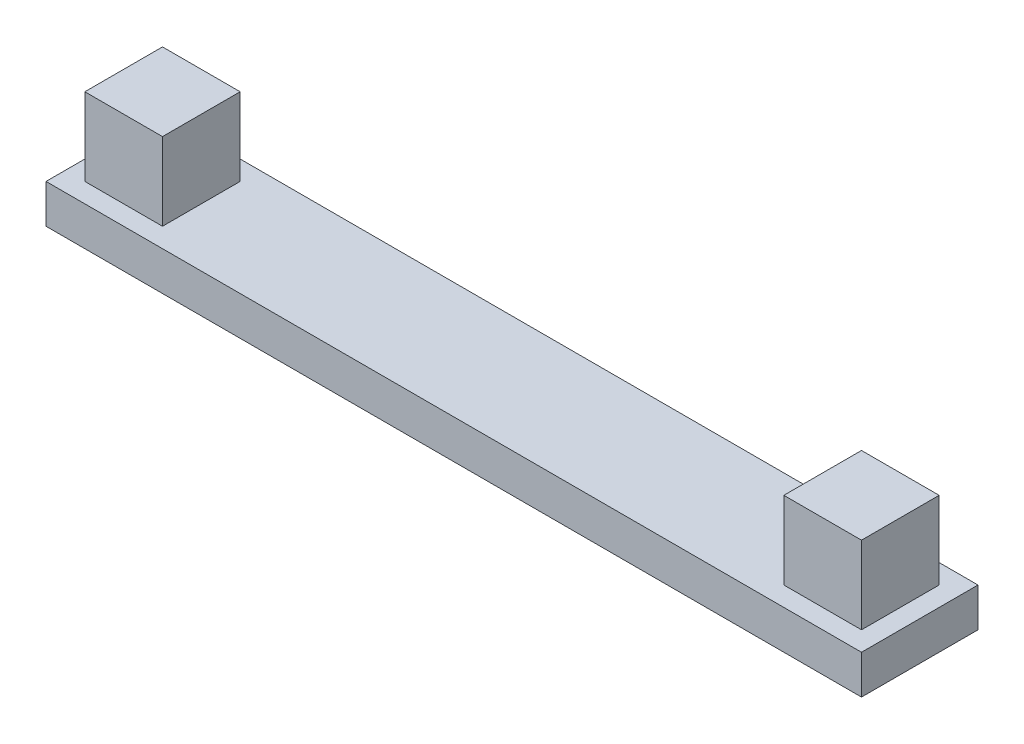
ISO-10303-21;
HEADER;
FILE_DESCRIPTION(('STEP AP214'),'2;1');
FILE_NAME('part.step','',(''),(''),'','','');
FILE_SCHEMA(('AUTOMOTIVE_DESIGN { 1 0 10303 214 1 1 1 1 }'));
ENDSEC;
DATA;
#1=APPLICATION_CONTEXT('core data for automotive mechanical design processes');
#2=APPLICATION_PROTOCOL_DEFINITION('international standard','automotive_design',2000,#1);
#3=PRODUCT_CONTEXT('',#1,'mechanical');
#4=PRODUCT('Part','Part','',(#3));
#5=PRODUCT_RELATED_PRODUCT_CATEGORY('part','',(#4));
#6=PRODUCT_DEFINITION_FORMATION('','',#4);
#7=PRODUCT_DEFINITION_CONTEXT('part definition',#1,'design');
#8=PRODUCT_DEFINITION('design','',#6,#7);
#9=PRODUCT_DEFINITION_SHAPE('','',#8);
#10=(LENGTH_UNIT() NAMED_UNIT(*) SI_UNIT(.MILLI.,.METRE.));
#11=(NAMED_UNIT(*) PLANE_ANGLE_UNIT() SI_UNIT($,.RADIAN.));
#12=(NAMED_UNIT(*) SI_UNIT($,.STERADIAN.) SOLID_ANGLE_UNIT());
#13=UNCERTAINTY_MEASURE_WITH_UNIT(LENGTH_MEASURE(1.E-05),#10,'distance_accuracy_value','');
#14=(GEOMETRIC_REPRESENTATION_CONTEXT(3) GLOBAL_UNCERTAINTY_ASSIGNED_CONTEXT((#13)) GLOBAL_UNIT_ASSIGNED_CONTEXT((#10,
#11,#12)) REPRESENTATION_CONTEXT('',''));
#15=CARTESIAN_POINT('',(0.,0.,0.));
#16=DIRECTION('',(0.,0.,1.));
#17=DIRECTION('',(1.,0.,0.));
#18=AXIS2_PLACEMENT_3D('',#15,#16,#17);
#19=CARTESIAN_POINT('',(0.,1.,0.));
#20=DIRECTION('',(0.,0.,-1.));
#21=DIRECTION('',(-1.,0.,0.));
#22=AXIS2_PLACEMENT_3D('',#19,#20,#21);
#23=PLANE('',#22);
#24=DIRECTION('',(1.,0.,0.));
#25=VECTOR('',#24,1.);
#26=CARTESIAN_POINT('',(0.,0.,0.));
#27=LINE('',#26,#25);
#28=CARTESIAN_POINT('',(0.,0.,0.));
#29=VERTEX_POINT('',#28);
#30=CARTESIAN_POINT('',(21.,0.,0.));
#31=VERTEX_POINT('',#30);
#32=EDGE_CURVE('E136',#29,#31,#27,.T.);
#33=ORIENTED_EDGE('',*,*,#32,.T.);
#34=DIRECTION('',(0.,-1.,0.));
#35=VECTOR('',#34,1.);
#36=CARTESIAN_POINT('',(21.,1.,0.));
#37=LINE('',#36,#35);
#38=CARTESIAN_POINT('',(21.,1.,0.));
#39=VERTEX_POINT('',#38);
#40=EDGE_CURVE('E11',#39,#31,#37,.T.);
#41=ORIENTED_EDGE('',*,*,#40,.F.);
#42=DIRECTION('',(1.,0.,0.));
#43=VECTOR('',#42,1.);
#44=CARTESIAN_POINT('',(0.,1.,0.));
#45=LINE('',#44,#43);
#46=CARTESIAN_POINT('',(0.,1.,0.));
#47=VERTEX_POINT('',#46);
#48=EDGE_CURVE('E101',#47,#39,#45,.T.);
#49=ORIENTED_EDGE('',*,*,#48,.F.);
#50=DIRECTION('',(0.,-1.,0.));
#51=VECTOR('',#50,1.);
#52=CARTESIAN_POINT('',(0.,1.,0.));
#53=LINE('',#52,#51);
#54=EDGE_CURVE('E78',#47,#29,#53,.T.);
#55=ORIENTED_EDGE('',*,*,#54,.T.);
#56=EDGE_LOOP('',(#33,#41,#49,#55));
#57=FACE_BOUND('',#56,.T.);
#58=ADVANCED_FACE('F35',(#57),#23,.F.);
#59=CARTESIAN_POINT('',(21.,1.,0.));
#60=DIRECTION('',(-1.,0.,0.));
#61=DIRECTION('',(0.,0.,1.));
#62=AXIS2_PLACEMENT_3D('',#59,#60,#61);
#63=PLANE('',#62);
#64=DIRECTION('',(0.,0.,-1.));
#65=VECTOR('',#64,1.);
#66=CARTESIAN_POINT('',(21.,0.,0.));
#67=LINE('',#66,#65);
#68=CARTESIAN_POINT('',(21.,0.,-3.));
#69=VERTEX_POINT('',#68);
#70=EDGE_CURVE('E138',#31,#69,#67,.T.);
#71=ORIENTED_EDGE('',*,*,#70,.T.);
#72=DIRECTION('',(0.,-1.,0.));
#73=VECTOR('',#72,1.);
#74=CARTESIAN_POINT('',(21.,1.,-3.));
#75=LINE('',#74,#73);
#76=CARTESIAN_POINT('',(21.,1.,-3.));
#77=VERTEX_POINT('',#76);
#78=EDGE_CURVE('E43',#77,#69,#75,.T.);
#79=ORIENTED_EDGE('',*,*,#78,.F.);
#80=DIRECTION('',(0.,0.,-1.));
#81=VECTOR('',#80,1.);
#82=CARTESIAN_POINT('',(21.,1.,0.));
#83=LINE('',#82,#81);
#84=EDGE_CURVE('E86',#39,#77,#83,.T.);
#85=ORIENTED_EDGE('',*,*,#84,.F.);
#86=ORIENTED_EDGE('',*,*,#40,.T.);
#87=EDGE_LOOP('',(#71,#79,#85,#86));
#88=FACE_BOUND('',#87,.T.);
#89=ADVANCED_FACE('F148',(#88),#63,.F.);
#90=CARTESIAN_POINT('',(0.,1.,-3.));
#91=DIRECTION('',(0.,0.,-1.));
#92=DIRECTION('',(-1.,0.,0.));
#93=AXIS2_PLACEMENT_3D('',#90,#91,#92);
#94=PLANE('',#93);
#95=DIRECTION('',(1.,0.,0.));
#96=VECTOR('',#95,1.);
#97=CARTESIAN_POINT('',(0.,0.,-3.));
#98=LINE('',#97,#96);
#99=CARTESIAN_POINT('',(0.,0.,-3.));
#100=VERTEX_POINT('',#99);
#101=EDGE_CURVE('E142',#100,#69,#98,.T.);
#102=ORIENTED_EDGE('',*,*,#101,.F.);
#103=DIRECTION('',(0.,-1.,0.));
#104=VECTOR('',#103,1.);
#105=CARTESIAN_POINT('',(0.,1.,-3.));
#106=LINE('',#105,#104);
#107=CARTESIAN_POINT('',(0.,1.,-3.));
#108=VERTEX_POINT('',#107);
#109=EDGE_CURVE('E70',#108,#100,#106,.T.);
#110=ORIENTED_EDGE('',*,*,#109,.F.);
#111=DIRECTION('',(1.,0.,0.));
#112=VECTOR('',#111,1.);
#113=CARTESIAN_POINT('',(0.,1.,-3.));
#114=LINE('',#113,#112);
#115=EDGE_CURVE('E108',#108,#77,#114,.T.);
#116=ORIENTED_EDGE('',*,*,#115,.T.);
#117=ORIENTED_EDGE('',*,*,#78,.T.);
#118=EDGE_LOOP('',(#102,#110,#116,#117));
#119=FACE_BOUND('',#118,.T.);
#120=ADVANCED_FACE('F147',(#119),#94,.T.);
#121=CARTESIAN_POINT('',(0.,1.,0.));
#122=DIRECTION('',(-1.,0.,0.));
#123=DIRECTION('',(0.,0.,1.));
#124=AXIS2_PLACEMENT_3D('',#121,#122,#123);
#125=PLANE('',#124);
#126=DIRECTION('',(0.,0.,-1.));
#127=VECTOR('',#126,1.);
#128=CARTESIAN_POINT('',(0.,0.,0.));
#129=LINE('',#128,#127);
#130=EDGE_CURVE('E97',#29,#100,#129,.T.);
#131=ORIENTED_EDGE('',*,*,#130,.F.);
#132=ORIENTED_EDGE('',*,*,#54,.F.);
#133=DIRECTION('',(0.,0.,-1.));
#134=VECTOR('',#133,1.);
#135=CARTESIAN_POINT('',(0.,1.,0.));
#136=LINE('',#135,#134);
#137=EDGE_CURVE('E95',#47,#108,#136,.T.);
#138=ORIENTED_EDGE('',*,*,#137,.T.);
#139=ORIENTED_EDGE('',*,*,#109,.T.);
#140=EDGE_LOOP('',(#131,#132,#138,#139));
#141=FACE_BOUND('',#140,.T.);
#142=ADVANCED_FACE('F93',(#141),#125,.T.);
#143=CARTESIAN_POINT('',(0.,1.,0.));
#144=DIRECTION('',(0.,1.,0.));
#145=DIRECTION('',(0.,0.,1.));
#146=AXIS2_PLACEMENT_3D('',#143,#144,#145);
#147=PLANE('',#146);
#148=ORIENTED_EDGE('',*,*,#48,.T.);
#149=ORIENTED_EDGE('',*,*,#84,.T.);
#150=ORIENTED_EDGE('',*,*,#115,.F.);
#151=ORIENTED_EDGE('',*,*,#137,.F.);
#152=EDGE_LOOP('',(#148,#149,#150,#151));
#153=FACE_BOUND('',#152,.T.);
#154=DIRECTION('',(1.,0.,0.));
#155=VECTOR('',#154,1.);
#156=CARTESIAN_POINT('',(0.,1.,-2.5));
#157=LINE('',#156,#155);
#158=CARTESIAN_POINT('',(0.500000000000002,1.,-2.5));
#159=VERTEX_POINT('',#158);
#160=CARTESIAN_POINT('',(2.5,1.,-2.5));
#161=VERTEX_POINT('',#160);
#162=EDGE_CURVE('E109',#159,#161,#157,.T.);
#163=ORIENTED_EDGE('',*,*,#162,.T.);
#164=DIRECTION('',(0.,0.,1.));
#165=VECTOR('',#164,1.);
#166=CARTESIAN_POINT('',(2.5,1.,0.));
#167=LINE('',#166,#165);
#168=CARTESIAN_POINT('',(2.5,1.,-0.5));
#169=VERTEX_POINT('',#168);
#170=EDGE_CURVE('E112',#161,#169,#167,.T.);
#171=ORIENTED_EDGE('',*,*,#170,.T.);
#172=DIRECTION('',(1.,0.,0.));
#173=VECTOR('',#172,1.);
#174=CARTESIAN_POINT('',(0.,1.,-0.5));
#175=LINE('',#174,#173);
#176=CARTESIAN_POINT('',(0.500000000000002,1.,-0.5));
#177=VERTEX_POINT('',#176);
#178=EDGE_CURVE('E119',#177,#169,#175,.T.);
#179=ORIENTED_EDGE('',*,*,#178,.F.);
#180=DIRECTION('',(0.,0.,1.));
#181=VECTOR('',#180,1.);
#182=CARTESIAN_POINT('',(0.500000000000002,1.,0.));
#183=LINE('',#182,#181);
#184=EDGE_CURVE('E122',#159,#177,#183,.T.);
#185=ORIENTED_EDGE('',*,*,#184,.F.);
#186=EDGE_LOOP('',(#163,#171,#179,#185));
#187=FACE_BOUND('',#186,.T.);
#188=DIRECTION('',(1.,0.,0.));
#189=VECTOR('',#188,1.);
#190=CARTESIAN_POINT('',(0.,1.,-2.5));
#191=LINE('',#190,#189);
#192=CARTESIAN_POINT('',(18.5,1.,-2.5));
#193=VERTEX_POINT('',#192);
#194=CARTESIAN_POINT('',(20.5,1.,-2.5));
#195=VERTEX_POINT('',#194);
#196=EDGE_CURVE('E125',#193,#195,#191,.T.);
#197=ORIENTED_EDGE('',*,*,#196,.T.);
#198=DIRECTION('',(0.,0.,1.));
#199=VECTOR('',#198,1.);
#200=CARTESIAN_POINT('',(20.5,1.,0.));
#201=LINE('',#200,#199);
#202=CARTESIAN_POINT('',(20.5,1.,-0.5));
#203=VERTEX_POINT('',#202);
#204=EDGE_CURVE('E128',#195,#203,#201,.T.);
#205=ORIENTED_EDGE('',*,*,#204,.T.);
#206=DIRECTION('',(1.,0.,0.));
#207=VECTOR('',#206,1.);
#208=CARTESIAN_POINT('',(0.,1.,-0.5));
#209=LINE('',#208,#207);
#210=CARTESIAN_POINT('',(18.5,1.,-0.5));
#211=VERTEX_POINT('',#210);
#212=EDGE_CURVE('E131',#211,#203,#209,.T.);
#213=ORIENTED_EDGE('',*,*,#212,.F.);
#214=DIRECTION('',(0.,0.,1.));
#215=VECTOR('',#214,1.);
#216=CARTESIAN_POINT('',(18.5,1.,0.));
#217=LINE('',#216,#215);
#218=EDGE_CURVE('E98',#193,#211,#217,.T.);
#219=ORIENTED_EDGE('',*,*,#218,.F.);
#220=EDGE_LOOP('',(#197,#205,#213,#219));
#221=FACE_BOUND('',#220,.T.);
#222=ADVANCED_FACE('F105',(#153,#187,#221),#147,.T.);
#223=CARTESIAN_POINT('',(0.,0.,0.));
#224=DIRECTION('',(0.,1.,0.));
#225=DIRECTION('',(0.,0.,1.));
#226=AXIS2_PLACEMENT_3D('',#223,#224,#225);
#227=PLANE('',#226);
#228=ORIENTED_EDGE('',*,*,#32,.F.);
#229=ORIENTED_EDGE('',*,*,#130,.T.);
#230=ORIENTED_EDGE('',*,*,#101,.T.);
#231=ORIENTED_EDGE('',*,*,#70,.F.);
#232=EDGE_LOOP('',(#228,#229,#230,#231));
#233=FACE_BOUND('',#232,.T.);
#234=ADVANCED_FACE('F150',(#233),#227,.F.);
#235=CARTESIAN_POINT('',(0.500000000000002,3.,-2.5));
#236=DIRECTION('',(1.,0.,0.));
#237=DIRECTION('',(0.,0.,-1.));
#238=AXIS2_PLACEMENT_3D('',#235,#236,#237);
#239=PLANE('',#238);
#240=ORIENTED_EDGE('',*,*,#184,.T.);
#241=DIRECTION('',(0.,-1.,0.));
#242=VECTOR('',#241,1.);
#243=CARTESIAN_POINT('',(0.500000000000002,3.,-0.5));
#244=LINE('',#243,#242);
#245=CARTESIAN_POINT('',(0.500000000000002,3.,-0.5));
#246=VERTEX_POINT('',#245);
#247=EDGE_CURVE('E139',#246,#177,#244,.T.);
#248=ORIENTED_EDGE('',*,*,#247,.F.);
#249=DIRECTION('',(0.,0.,1.));
#250=VECTOR('',#249,1.);
#251=CARTESIAN_POINT('',(0.500000000000002,3.,-2.5));
#252=LINE('',#251,#250);
#253=CARTESIAN_POINT('',(0.500000000000002,3.,-2.5));
#254=VERTEX_POINT('',#253);
#255=EDGE_CURVE('E301',#254,#246,#252,.T.);
#256=ORIENTED_EDGE('',*,*,#255,.F.);
#257=DIRECTION('',(0.,-1.,0.));
#258=VECTOR('',#257,1.);
#259=CARTESIAN_POINT('',(0.500000000000002,3.,-2.5));
#260=LINE('',#259,#258);
#261=EDGE_CURVE('E332',#254,#159,#260,.T.);
#262=ORIENTED_EDGE('',*,*,#261,.T.);
#263=EDGE_LOOP('',(#240,#248,#256,#262));
#264=FACE_BOUND('',#263,.T.);
#265=ADVANCED_FACE('F152',(#264),#239,.F.);
#266=CARTESIAN_POINT('',(0.500000000000002,3.,-0.5));
#267=DIRECTION('',(0.,0.,-1.));
#268=DIRECTION('',(-1.,0.,0.));
#269=AXIS2_PLACEMENT_3D('',#266,#267,#268);
#270=PLANE('',#269);
#271=ORIENTED_EDGE('',*,*,#178,.T.);
#272=DIRECTION('',(0.,-1.,0.));
#273=VECTOR('',#272,1.);
#274=CARTESIAN_POINT('',(2.5,3.,-0.5));
#275=LINE('',#274,#273);
#276=CARTESIAN_POINT('',(2.5,3.,-0.5));
#277=VERTEX_POINT('',#276);
#278=EDGE_CURVE('E337',#277,#169,#275,.T.);
#279=ORIENTED_EDGE('',*,*,#278,.F.);
#280=DIRECTION('',(1.,0.,0.));
#281=VECTOR('',#280,1.);
#282=CARTESIAN_POINT('',(0.500000000000002,3.,-0.5));
#283=LINE('',#282,#281);
#284=EDGE_CURVE('E323',#246,#277,#283,.T.);
#285=ORIENTED_EDGE('',*,*,#284,.F.);
#286=ORIENTED_EDGE('',*,*,#247,.T.);
#287=EDGE_LOOP('',(#271,#279,#285,#286));
#288=FACE_BOUND('',#287,.T.);
#289=ADVANCED_FACE('F158',(#288),#270,.F.);
#290=CARTESIAN_POINT('',(2.5,3.,-2.5));
#291=DIRECTION('',(1.,0.,0.));
#292=DIRECTION('',(0.,0.,-1.));
#293=AXIS2_PLACEMENT_3D('',#290,#291,#292);
#294=PLANE('',#293);
#295=ORIENTED_EDGE('',*,*,#278,.T.);
#296=ORIENTED_EDGE('',*,*,#170,.F.);
#297=DIRECTION('',(0.,-1.,0.));
#298=VECTOR('',#297,1.);
#299=CARTESIAN_POINT('',(2.5,3.,-2.5));
#300=LINE('',#299,#298);
#301=CARTESIAN_POINT('',(2.5,3.,-2.5));
#302=VERTEX_POINT('',#301);
#303=EDGE_CURVE('E335',#302,#161,#300,.T.);
#304=ORIENTED_EDGE('',*,*,#303,.F.);
#305=DIRECTION('',(0.,0.,1.));
#306=VECTOR('',#305,1.);
#307=CARTESIAN_POINT('',(2.5,3.,-2.5));
#308=LINE('',#307,#306);
#309=EDGE_CURVE('E326',#302,#277,#308,.T.);
#310=ORIENTED_EDGE('',*,*,#309,.T.);
#311=EDGE_LOOP('',(#295,#296,#304,#310));
#312=FACE_BOUND('',#311,.T.);
#313=ADVANCED_FACE('F201',(#312),#294,.T.);
#314=CARTESIAN_POINT('',(0.500000000000002,3.,-2.5));
#315=DIRECTION('',(0.,0.,-1.));
#316=DIRECTION('',(-1.,0.,0.));
#317=AXIS2_PLACEMENT_3D('',#314,#315,#316);
#318=PLANE('',#317);
#319=ORIENTED_EDGE('',*,*,#303,.T.);
#320=ORIENTED_EDGE('',*,*,#162,.F.);
#321=ORIENTED_EDGE('',*,*,#261,.F.);
#322=DIRECTION('',(1.,0.,0.));
#323=VECTOR('',#322,1.);
#324=CARTESIAN_POINT('',(0.500000000000002,3.,-2.5));
#325=LINE('',#324,#323);
#326=EDGE_CURVE('E329',#254,#302,#325,.T.);
#327=ORIENTED_EDGE('',*,*,#326,.T.);
#328=EDGE_LOOP('',(#319,#320,#321,#327));
#329=FACE_BOUND('',#328,.T.);
#330=ADVANCED_FACE('F211',(#329),#318,.T.);
#331=CARTESIAN_POINT('',(0.,3.,0.));
#332=DIRECTION('',(0.,1.,0.));
#333=DIRECTION('',(0.,0.,1.));
#334=AXIS2_PLACEMENT_3D('',#331,#332,#333);
#335=PLANE('',#334);
#336=ORIENTED_EDGE('',*,*,#255,.T.);
#337=ORIENTED_EDGE('',*,*,#284,.T.);
#338=ORIENTED_EDGE('',*,*,#309,.F.);
#339=ORIENTED_EDGE('',*,*,#326,.F.);
#340=EDGE_LOOP('',(#336,#337,#338,#339));
#341=FACE_BOUND('',#340,.T.);
#342=ADVANCED_FACE('F221',(#341),#335,.T.);
#343=CARTESIAN_POINT('',(18.5,3.,-2.5));
#344=DIRECTION('',(1.,0.,0.));
#345=DIRECTION('',(0.,0.,-1.));
#346=AXIS2_PLACEMENT_3D('',#343,#344,#345);
#347=PLANE('',#346);
#348=ORIENTED_EDGE('',*,*,#218,.T.);
#349=DIRECTION('',(0.,-1.,0.));
#350=VECTOR('',#349,1.);
#351=CARTESIAN_POINT('',(18.5,3.,-0.5));
#352=LINE('',#351,#350);
#353=CARTESIAN_POINT('',(18.5,3.,-0.5));
#354=VERTEX_POINT('',#353);
#355=EDGE_CURVE('E304',#354,#211,#352,.T.);
#356=ORIENTED_EDGE('',*,*,#355,.F.);
#357=DIRECTION('',(0.,0.,1.));
#358=VECTOR('',#357,1.);
#359=CARTESIAN_POINT('',(18.5,3.,-2.5));
#360=LINE('',#359,#358);
#361=CARTESIAN_POINT('',(18.5,3.,-2.5));
#362=VERTEX_POINT('',#361);
#363=EDGE_CURVE('E289',#362,#354,#360,.T.);
#364=ORIENTED_EDGE('',*,*,#363,.F.);
#365=DIRECTION('',(0.,-1.,0.));
#366=VECTOR('',#365,1.);
#367=CARTESIAN_POINT('',(18.5,3.,-2.5));
#368=LINE('',#367,#366);
#369=EDGE_CURVE('E314',#362,#193,#368,.T.);
#370=ORIENTED_EDGE('',*,*,#369,.T.);
#371=EDGE_LOOP('',(#348,#356,#364,#370));
#372=FACE_BOUND('',#371,.T.);
#373=ADVANCED_FACE('F231',(#372),#347,.F.);
#374=CARTESIAN_POINT('',(18.5,3.,-0.5));
#375=DIRECTION('',(0.,0.,-1.));
#376=DIRECTION('',(-1.,0.,0.));
#377=AXIS2_PLACEMENT_3D('',#374,#375,#376);
#378=PLANE('',#377);
#379=ORIENTED_EDGE('',*,*,#212,.T.);
#380=DIRECTION('',(0.,-1.,0.));
#381=VECTOR('',#380,1.);
#382=CARTESIAN_POINT('',(20.5,3.,-0.5));
#383=LINE('',#382,#381);
#384=CARTESIAN_POINT('',(20.5,3.,-0.5));
#385=VERTEX_POINT('',#384);
#386=EDGE_CURVE('E308',#385,#203,#383,.T.);
#387=ORIENTED_EDGE('',*,*,#386,.F.);
#388=DIRECTION('',(1.,0.,0.));
#389=VECTOR('',#388,1.);
#390=CARTESIAN_POINT('',(18.5,3.,-0.5));
#391=LINE('',#390,#389);
#392=EDGE_CURVE('E294',#354,#385,#391,.T.);
#393=ORIENTED_EDGE('',*,*,#392,.F.);
#394=ORIENTED_EDGE('',*,*,#355,.T.);
#395=EDGE_LOOP('',(#379,#387,#393,#394));
#396=FACE_BOUND('',#395,.T.);
#397=ADVANCED_FACE('F241',(#396),#378,.F.);
#398=CARTESIAN_POINT('',(20.5,3.,-2.5));
#399=DIRECTION('',(1.,0.,0.));
#400=DIRECTION('',(0.,0.,-1.));
#401=AXIS2_PLACEMENT_3D('',#398,#399,#400);
#402=PLANE('',#401);
#403=ORIENTED_EDGE('',*,*,#386,.T.);
#404=ORIENTED_EDGE('',*,*,#204,.F.);
#405=DIRECTION('',(0.,-1.,0.));
#406=VECTOR('',#405,1.);
#407=CARTESIAN_POINT('',(20.5,3.,-2.5));
#408=LINE('',#407,#406);
#409=CARTESIAN_POINT('',(20.5,3.,-2.5));
#410=VERTEX_POINT('',#409);
#411=EDGE_CURVE('E51',#410,#195,#408,.T.);
#412=ORIENTED_EDGE('',*,*,#411,.F.);
#413=DIRECTION('',(0.,0.,1.));
#414=VECTOR('',#413,1.);
#415=CARTESIAN_POINT('',(20.5,3.,-2.5));
#416=LINE('',#415,#414);
#417=EDGE_CURVE('E317',#410,#385,#416,.T.);
#418=ORIENTED_EDGE('',*,*,#417,.T.);
#419=EDGE_LOOP('',(#403,#404,#412,#418));
#420=FACE_BOUND('',#419,.T.);
#421=ADVANCED_FACE('F251',(#420),#402,.T.);
#422=CARTESIAN_POINT('',(18.5,3.,-2.5));
#423=DIRECTION('',(0.,0.,-1.));
#424=DIRECTION('',(-1.,0.,0.));
#425=AXIS2_PLACEMENT_3D('',#422,#423,#424);
#426=PLANE('',#425);
#427=ORIENTED_EDGE('',*,*,#411,.T.);
#428=ORIENTED_EDGE('',*,*,#196,.F.);
#429=ORIENTED_EDGE('',*,*,#369,.F.);
#430=DIRECTION('',(1.,0.,0.));
#431=VECTOR('',#430,1.);
#432=CARTESIAN_POINT('',(18.5,3.,-2.5));
#433=LINE('',#432,#431);
#434=EDGE_CURVE('E297',#362,#410,#433,.T.);
#435=ORIENTED_EDGE('',*,*,#434,.T.);
#436=EDGE_LOOP('',(#427,#428,#429,#435));
#437=FACE_BOUND('',#436,.T.);
#438=ADVANCED_FACE('F261',(#437),#426,.T.);
#439=CARTESIAN_POINT('',(0.,3.,0.));
#440=DIRECTION('',(0.,1.,0.));
#441=DIRECTION('',(0.,0.,1.));
#442=AXIS2_PLACEMENT_3D('',#439,#440,#441);
#443=PLANE('',#442);
#444=ORIENTED_EDGE('',*,*,#363,.T.);
#445=ORIENTED_EDGE('',*,*,#392,.T.);
#446=ORIENTED_EDGE('',*,*,#417,.F.);
#447=ORIENTED_EDGE('',*,*,#434,.F.);
#448=EDGE_LOOP('',(#444,#445,#446,#447));
#449=FACE_BOUND('',#448,.T.);
#450=ADVANCED_FACE('F271',(#449),#443,.T.);
#451=CLOSED_SHELL('',(#58,#89,#120,#142,#222,#234,#265,#289,#313,#330,#342,#373,#397,#421,#438,#450));
#452=MANIFOLD_SOLID_BREP('B2',#451);
#453=ADVANCED_BREP_SHAPE_REPRESENTATION('',(#18,#452),#14);
#454=SHAPE_DEFINITION_REPRESENTATION(#9,#453);
ENDSEC;
END-ISO-10303-21;
